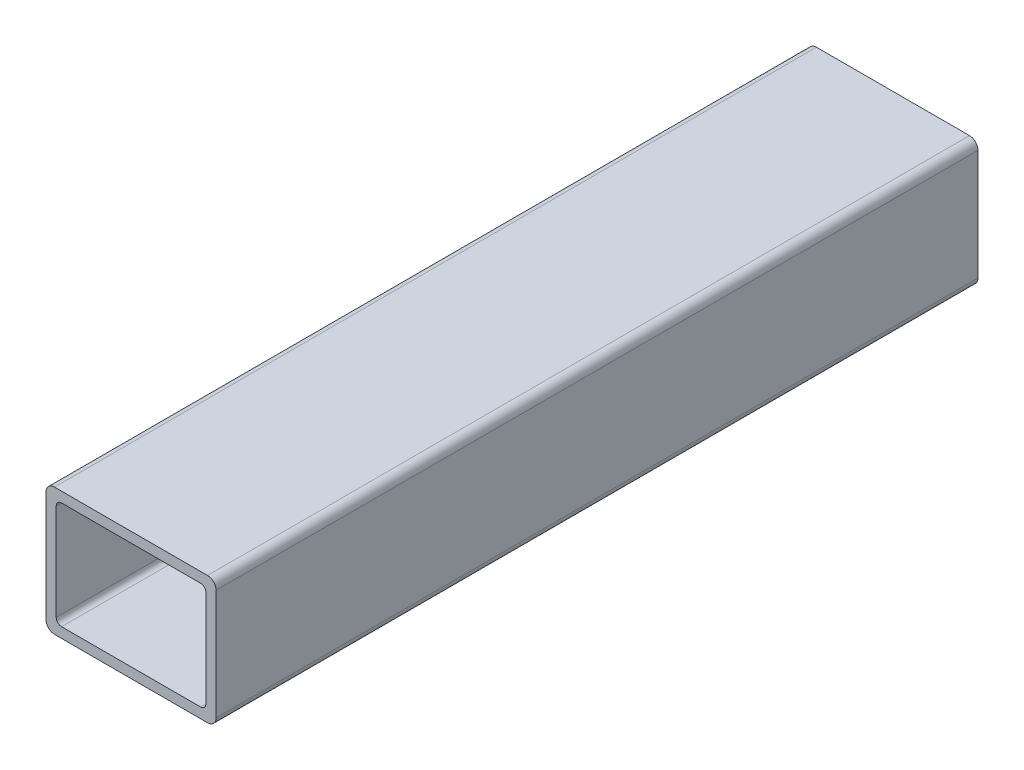
ISO-10303-21;
HEADER;
FILE_DESCRIPTION(('STEP AP214'),'2;1');
FILE_NAME('part.step','',(''),(''),'','','');
FILE_SCHEMA(('AUTOMOTIVE_DESIGN { 1 0 10303 214 1 1 1 1 }'));
ENDSEC;
DATA;
#1=APPLICATION_CONTEXT('core data for automotive mechanical design processes');
#2=APPLICATION_PROTOCOL_DEFINITION('international standard','automotive_design',2000,#1);
#3=PRODUCT_CONTEXT('',#1,'mechanical');
#4=PRODUCT('Part','Part','',(#3));
#5=PRODUCT_RELATED_PRODUCT_CATEGORY('part','',(#4));
#6=PRODUCT_DEFINITION_FORMATION('','',#4);
#7=PRODUCT_DEFINITION_CONTEXT('part definition',#1,'design');
#8=PRODUCT_DEFINITION('design','',#6,#7);
#9=PRODUCT_DEFINITION_SHAPE('','',#8);
#10=(LENGTH_UNIT() NAMED_UNIT(*) SI_UNIT(.MILLI.,.METRE.));
#11=(NAMED_UNIT(*) PLANE_ANGLE_UNIT() SI_UNIT($,.RADIAN.));
#12=(NAMED_UNIT(*) SI_UNIT($,.STERADIAN.) SOLID_ANGLE_UNIT());
#13=UNCERTAINTY_MEASURE_WITH_UNIT(LENGTH_MEASURE(1.E-05),#10,'distance_accuracy_value','');
#14=(GEOMETRIC_REPRESENTATION_CONTEXT(3) GLOBAL_UNCERTAINTY_ASSIGNED_CONTEXT((#13)) GLOBAL_UNIT_ASSIGNED_CONTEXT((#10,
#11,#12)) REPRESENTATION_CONTEXT('',''));
#15=CARTESIAN_POINT('',(0.,0.,0.));
#16=DIRECTION('',(0.,0.,1.));
#17=DIRECTION('',(1.,0.,0.));
#18=AXIS2_PLACEMENT_3D('',#15,#16,#17);
#19=CARTESIAN_POINT('',(22.86,-16.51,227.56368));
#20=DIRECTION('',(0.,0.,1.));
#21=DIRECTION('',(1.,0.,0.));
#22=AXIS2_PLACEMENT_3D('',#19,#20,#21);
#23=PLANE('',#22);
#24=CARTESIAN_POINT('',(22.86,-16.51,227.56368));
#25=DIRECTION('',(0.,0.,1.));
#26=DIRECTION('',(1.,0.,0.));
#27=AXIS2_PLACEMENT_3D('',#24,#25,#26);
#28=CIRCLE('',#27,2.53999999999999);
#29=CARTESIAN_POINT('',(22.86,-19.05,227.56368));
#30=VERTEX_POINT('',#29);
#31=CARTESIAN_POINT('',(25.4,-16.51,227.56368));
#32=VERTEX_POINT('',#31);
#33=EDGE_CURVE('E244',#30,#32,#28,.T.);
#34=ORIENTED_EDGE('',*,*,#33,.T.);
#35=DIRECTION('',(0.,1.,0.));
#36=VECTOR('',#35,1.);
#37=CARTESIAN_POINT('',(25.4,-16.51,227.56368));
#38=LINE('',#37,#36);
#39=CARTESIAN_POINT('',(25.4,16.51,227.56368));
#40=VERTEX_POINT('',#39);
#41=EDGE_CURVE('E248',#32,#40,#38,.T.);
#42=ORIENTED_EDGE('',*,*,#41,.T.);
#43=CARTESIAN_POINT('',(22.86,16.51,227.56368));
#44=DIRECTION('',(0.,0.,1.));
#45=DIRECTION('',(1.,0.,0.));
#46=AXIS2_PLACEMENT_3D('',#43,#44,#45);
#47=CIRCLE('',#46,2.54);
#48=CARTESIAN_POINT('',(22.86,19.05,227.56368));
#49=VERTEX_POINT('',#48);
#50=EDGE_CURVE('E252',#40,#49,#47,.T.);
#51=ORIENTED_EDGE('',*,*,#50,.T.);
#52=DIRECTION('',(-1.,0.,0.));
#53=VECTOR('',#52,1.);
#54=CARTESIAN_POINT('',(22.86,19.05,227.56368));
#55=LINE('',#54,#53);
#56=CARTESIAN_POINT('',(-22.86,19.05,227.56368));
#57=VERTEX_POINT('',#56);
#58=EDGE_CURVE('E255',#49,#57,#55,.T.);
#59=ORIENTED_EDGE('',*,*,#58,.T.);
#60=CARTESIAN_POINT('',(-22.86,16.51,227.56368));
#61=DIRECTION('',(0.,0.,1.));
#62=DIRECTION('',(1.,0.,0.));
#63=AXIS2_PLACEMENT_3D('',#60,#61,#62);
#64=CIRCLE('',#63,2.54);
#65=CARTESIAN_POINT('',(-25.4,16.51,227.56368));
#66=VERTEX_POINT('',#65);
#67=EDGE_CURVE('E258',#57,#66,#64,.T.);
#68=ORIENTED_EDGE('',*,*,#67,.T.);
#69=DIRECTION('',(0.,-1.,0.));
#70=VECTOR('',#69,1.);
#71=CARTESIAN_POINT('',(-25.4,-16.51,227.56368));
#72=LINE('',#71,#70);
#73=CARTESIAN_POINT('',(-25.4,-16.51,227.56368));
#74=VERTEX_POINT('',#73);
#75=EDGE_CURVE('E261',#66,#74,#72,.T.);
#76=ORIENTED_EDGE('',*,*,#75,.T.);
#77=CARTESIAN_POINT('',(-22.86,-16.51,227.56368));
#78=DIRECTION('',(0.,0.,1.));
#79=DIRECTION('',(1.,0.,0.));
#80=AXIS2_PLACEMENT_3D('',#77,#78,#79);
#81=CIRCLE('',#80,2.54);
#82=CARTESIAN_POINT('',(-22.86,-19.05,227.56368));
#83=VERTEX_POINT('',#82);
#84=EDGE_CURVE('E264',#74,#83,#81,.T.);
#85=ORIENTED_EDGE('',*,*,#84,.T.);
#86=DIRECTION('',(1.,0.,0.));
#87=VECTOR('',#86,1.);
#88=CARTESIAN_POINT('',(22.86,-19.05,227.56368));
#89=LINE('',#88,#87);
#90=EDGE_CURVE('E267',#83,#30,#89,.T.);
#91=ORIENTED_EDGE('',*,*,#90,.T.);
#92=EDGE_LOOP('',(#34,#42,#51,#59,#68,#76,#85,#91));
#93=FACE_BOUND('',#92,.T.);
#94=DIRECTION('',(-1.,0.,0.));
#95=VECTOR('',#94,1.);
#96=CARTESIAN_POINT('',(20.7518,16.002,227.56368));
#97=LINE('',#96,#95);
#98=CARTESIAN_POINT('',(20.7518,16.002,227.56368));
#99=VERTEX_POINT('',#98);
#100=CARTESIAN_POINT('',(-20.7518,16.002,227.56368));
#101=VERTEX_POINT('',#100);
#102=EDGE_CURVE('E164',#99,#101,#97,.T.);
#103=ORIENTED_EDGE('',*,*,#102,.F.);
#104=CARTESIAN_POINT('',(20.7518,14.4018,227.56368));
#105=DIRECTION('',(0.,0.,1.));
#106=DIRECTION('',(1.,0.,0.));
#107=AXIS2_PLACEMENT_3D('',#104,#105,#106);
#108=CIRCLE('',#107,1.6002);
#109=CARTESIAN_POINT('',(22.352,14.4018,227.56368));
#110=VERTEX_POINT('',#109);
#111=EDGE_CURVE('E155',#110,#99,#108,.T.);
#112=ORIENTED_EDGE('',*,*,#111,.F.);
#113=DIRECTION('',(0.,1.,0.));
#114=VECTOR('',#113,1.);
#115=CARTESIAN_POINT('',(22.352,14.4018,227.56368));
#116=LINE('',#115,#114);
#117=CARTESIAN_POINT('',(22.352,-14.4018,227.56368));
#118=VERTEX_POINT('',#117);
#119=EDGE_CURVE('E196',#118,#110,#116,.T.);
#120=ORIENTED_EDGE('',*,*,#119,.F.);
#121=CARTESIAN_POINT('',(20.7518,-14.4018,227.56368));
#122=DIRECTION('',(0.,0.,1.));
#123=DIRECTION('',(1.,0.,0.));
#124=AXIS2_PLACEMENT_3D('',#121,#122,#123);
#125=CIRCLE('',#124,1.6002);
#126=CARTESIAN_POINT('',(20.7518,-16.002,227.56368));
#127=VERTEX_POINT('',#126);
#128=EDGE_CURVE('E193',#127,#118,#125,.T.);
#129=ORIENTED_EDGE('',*,*,#128,.F.);
#130=DIRECTION('',(1.,0.,0.));
#131=VECTOR('',#130,1.);
#132=CARTESIAN_POINT('',(20.7518,-16.002,227.56368));
#133=LINE('',#132,#131);
#134=CARTESIAN_POINT('',(-20.7518,-16.002,227.56368));
#135=VERTEX_POINT('',#134);
#136=EDGE_CURVE('E190',#135,#127,#133,.T.);
#137=ORIENTED_EDGE('',*,*,#136,.F.);
#138=CARTESIAN_POINT('',(-20.7518,-14.4018,227.56368));
#139=DIRECTION('',(0.,0.,1.));
#140=DIRECTION('',(1.,0.,0.));
#141=AXIS2_PLACEMENT_3D('',#138,#139,#140);
#142=CIRCLE('',#141,1.6002);
#143=CARTESIAN_POINT('',(-22.352,-14.4018,227.56368));
#144=VERTEX_POINT('',#143);
#145=EDGE_CURVE('E187',#144,#135,#142,.T.);
#146=ORIENTED_EDGE('',*,*,#145,.F.);
#147=DIRECTION('',(0.,-1.,0.));
#148=VECTOR('',#147,1.);
#149=CARTESIAN_POINT('',(-22.352,14.4018,227.56368));
#150=LINE('',#149,#148);
#151=CARTESIAN_POINT('',(-22.352,14.4018,227.56368));
#152=VERTEX_POINT('',#151);
#153=EDGE_CURVE('E182',#152,#144,#150,.T.);
#154=ORIENTED_EDGE('',*,*,#153,.F.);
#155=CARTESIAN_POINT('',(-20.7518,14.4018,227.56368));
#156=DIRECTION('',(0.,0.,1.));
#157=DIRECTION('',(1.,0.,0.));
#158=AXIS2_PLACEMENT_3D('',#155,#156,#157);
#159=CIRCLE('',#158,1.6002);
#160=EDGE_CURVE('E178',#101,#152,#159,.T.);
#161=ORIENTED_EDGE('',*,*,#160,.F.);
#162=EDGE_LOOP('',(#103,#112,#120,#129,#137,#146,#154,#161));
#163=FACE_BOUND('',#162,.T.);
#164=ADVANCED_FACE('F41',(#93,#163),#23,.T.);
#165=CARTESIAN_POINT('',(22.86,-16.51,0.));
#166=DIRECTION('',(0.,0.,1.));
#167=DIRECTION('',(1.,0.,0.));
#168=AXIS2_PLACEMENT_3D('',#165,#166,#167);
#169=PLANE('',#168);
#170=CARTESIAN_POINT('',(22.86,-16.51,0.));
#171=DIRECTION('',(0.,0.,1.));
#172=DIRECTION('',(1.,0.,0.));
#173=AXIS2_PLACEMENT_3D('',#170,#171,#172);
#174=CIRCLE('',#173,2.53999999999999);
#175=CARTESIAN_POINT('',(22.86,-19.05,0.));
#176=VERTEX_POINT('',#175);
#177=CARTESIAN_POINT('',(25.4,-16.51,0.));
#178=VERTEX_POINT('',#177);
#179=EDGE_CURVE('E173',#176,#178,#174,.T.);
#180=ORIENTED_EDGE('',*,*,#179,.F.);
#181=DIRECTION('',(1.,0.,0.));
#182=VECTOR('',#181,1.);
#183=CARTESIAN_POINT('',(22.86,-19.05,0.));
#184=LINE('',#183,#182);
#185=CARTESIAN_POINT('',(-22.86,-19.05,0.));
#186=VERTEX_POINT('',#185);
#187=EDGE_CURVE('E249',#186,#176,#184,.T.);
#188=ORIENTED_EDGE('',*,*,#187,.F.);
#189=CARTESIAN_POINT('',(-22.86,-16.51,0.));
#190=DIRECTION('',(0.,0.,1.));
#191=DIRECTION('',(1.,0.,0.));
#192=AXIS2_PLACEMENT_3D('',#189,#190,#191);
#193=CIRCLE('',#192,2.54);
#194=CARTESIAN_POINT('',(-25.4,-16.51,0.));
#195=VERTEX_POINT('',#194);
#196=EDGE_CURVE('E289',#195,#186,#193,.T.);
#197=ORIENTED_EDGE('',*,*,#196,.F.);
#198=DIRECTION('',(0.,-1.,0.));
#199=VECTOR('',#198,1.);
#200=CARTESIAN_POINT('',(-25.4,-16.51,0.));
#201=LINE('',#200,#199);
#202=CARTESIAN_POINT('',(-25.4,16.51,0.));
#203=VERTEX_POINT('',#202);
#204=EDGE_CURVE('E286',#203,#195,#201,.T.);
#205=ORIENTED_EDGE('',*,*,#204,.F.);
#206=CARTESIAN_POINT('',(-22.86,16.51,0.));
#207=DIRECTION('',(0.,0.,1.));
#208=DIRECTION('',(1.,0.,0.));
#209=AXIS2_PLACEMENT_3D('',#206,#207,#208);
#210=CIRCLE('',#209,2.54);
#211=CARTESIAN_POINT('',(-22.86,19.05,0.));
#212=VERTEX_POINT('',#211);
#213=EDGE_CURVE('E283',#212,#203,#210,.T.);
#214=ORIENTED_EDGE('',*,*,#213,.F.);
#215=DIRECTION('',(-1.,0.,0.));
#216=VECTOR('',#215,1.);
#217=CARTESIAN_POINT('',(22.86,19.05,0.));
#218=LINE('',#217,#216);
#219=CARTESIAN_POINT('',(22.86,19.05,0.));
#220=VERTEX_POINT('',#219);
#221=EDGE_CURVE('E280',#220,#212,#218,.T.);
#222=ORIENTED_EDGE('',*,*,#221,.F.);
#223=CARTESIAN_POINT('',(22.86,16.51,0.));
#224=DIRECTION('',(0.,0.,1.));
#225=DIRECTION('',(1.,0.,0.));
#226=AXIS2_PLACEMENT_3D('',#223,#224,#225);
#227=CIRCLE('',#226,2.54);
#228=CARTESIAN_POINT('',(25.4,16.51,0.));
#229=VERTEX_POINT('',#228);
#230=EDGE_CURVE('E277',#229,#220,#227,.T.);
#231=ORIENTED_EDGE('',*,*,#230,.F.);
#232=DIRECTION('',(0.,1.,0.));
#233=VECTOR('',#232,1.);
#234=CARTESIAN_POINT('',(25.4,-16.51,0.));
#235=LINE('',#234,#233);
#236=EDGE_CURVE('E274',#178,#229,#235,.T.);
#237=ORIENTED_EDGE('',*,*,#236,.F.);
#238=EDGE_LOOP('',(#180,#188,#197,#205,#214,#222,#231,#237));
#239=FACE_BOUND('',#238,.T.);
#240=CARTESIAN_POINT('',(20.7518,14.4018,0.));
#241=DIRECTION('',(0.,0.,1.));
#242=DIRECTION('',(1.,0.,0.));
#243=AXIS2_PLACEMENT_3D('',#240,#241,#242);
#244=CIRCLE('',#243,1.6002);
#245=CARTESIAN_POINT('',(22.352,14.4018,0.));
#246=VERTEX_POINT('',#245);
#247=CARTESIAN_POINT('',(20.7518,16.002,0.));
#248=VERTEX_POINT('',#247);
#249=EDGE_CURVE('E65',#246,#248,#244,.T.);
#250=ORIENTED_EDGE('',*,*,#249,.T.);
#251=DIRECTION('',(-1.,0.,0.));
#252=VECTOR('',#251,1.);
#253=CARTESIAN_POINT('',(20.7518,16.002,0.));
#254=LINE('',#253,#252);
#255=CARTESIAN_POINT('',(-20.7518,16.002,0.));
#256=VERTEX_POINT('',#255);
#257=EDGE_CURVE('E171',#248,#256,#254,.T.);
#258=ORIENTED_EDGE('',*,*,#257,.T.);
#259=CARTESIAN_POINT('',(-20.7518,14.4018,0.));
#260=DIRECTION('',(0.,0.,1.));
#261=DIRECTION('',(1.,0.,0.));
#262=AXIS2_PLACEMENT_3D('',#259,#260,#261);
#263=CIRCLE('',#262,1.6002);
#264=CARTESIAN_POINT('',(-22.352,14.4018,0.));
#265=VERTEX_POINT('',#264);
#266=EDGE_CURVE('E203',#256,#265,#263,.T.);
#267=ORIENTED_EDGE('',*,*,#266,.T.);
#268=DIRECTION('',(0.,-1.,0.));
#269=VECTOR('',#268,1.);
#270=CARTESIAN_POINT('',(-22.352,14.4018,0.));
#271=LINE('',#270,#269);
#272=CARTESIAN_POINT('',(-22.352,-14.4018,0.));
#273=VERTEX_POINT('',#272);
#274=EDGE_CURVE('E207',#265,#273,#271,.T.);
#275=ORIENTED_EDGE('',*,*,#274,.T.);
#276=CARTESIAN_POINT('',(-20.7518,-14.4018,0.));
#277=DIRECTION('',(0.,0.,1.));
#278=DIRECTION('',(1.,0.,0.));
#279=AXIS2_PLACEMENT_3D('',#276,#277,#278);
#280=CIRCLE('',#279,1.6002);
#281=CARTESIAN_POINT('',(-20.7518,-16.002,0.));
#282=VERTEX_POINT('',#281);
#283=EDGE_CURVE('E211',#273,#282,#280,.T.);
#284=ORIENTED_EDGE('',*,*,#283,.T.);
#285=DIRECTION('',(1.,0.,0.));
#286=VECTOR('',#285,1.);
#287=CARTESIAN_POINT('',(20.7518,-16.002,0.));
#288=LINE('',#287,#286);
#289=CARTESIAN_POINT('',(20.7518,-16.002,0.));
#290=VERTEX_POINT('',#289);
#291=EDGE_CURVE('E215',#282,#290,#288,.T.);
#292=ORIENTED_EDGE('',*,*,#291,.T.);
#293=CARTESIAN_POINT('',(20.7518,-14.4018,0.));
#294=DIRECTION('',(0.,0.,1.));
#295=DIRECTION('',(1.,0.,0.));
#296=AXIS2_PLACEMENT_3D('',#293,#294,#295);
#297=CIRCLE('',#296,1.6002);
#298=CARTESIAN_POINT('',(22.352,-14.4018,0.));
#299=VERTEX_POINT('',#298);
#300=EDGE_CURVE('E219',#290,#299,#297,.T.);
#301=ORIENTED_EDGE('',*,*,#300,.T.);
#302=DIRECTION('',(0.,1.,0.));
#303=VECTOR('',#302,1.);
#304=CARTESIAN_POINT('',(22.352,14.4018,0.));
#305=LINE('',#304,#303);
#306=EDGE_CURVE('E165',#299,#246,#305,.T.);
#307=ORIENTED_EDGE('',*,*,#306,.T.);
#308=EDGE_LOOP('',(#250,#258,#267,#275,#284,#292,#301,#307));
#309=FACE_BOUND('',#308,.T.);
#310=ADVANCED_FACE('F328',(#239,#309),#169,.F.);
#311=CARTESIAN_POINT('',(22.86,-16.51,227.56368));
#312=DIRECTION('',(0.,0.,-1.));
#313=DIRECTION('',(-1.,0.,0.));
#314=AXIS2_PLACEMENT_3D('',#311,#312,#313);
#315=CYLINDRICAL_SURFACE('',#314,2.53999999999999);
#316=ORIENTED_EDGE('',*,*,#179,.T.);
#317=DIRECTION('',(0.,0.,-1.));
#318=VECTOR('',#317,1.);
#319=CARTESIAN_POINT('',(25.4,-16.51,227.56368));
#320=LINE('',#319,#318);
#321=EDGE_CURVE('E11',#32,#178,#320,.T.);
#322=ORIENTED_EDGE('',*,*,#321,.F.);
#323=ORIENTED_EDGE('',*,*,#33,.F.);
#324=DIRECTION('',(0.,0.,-1.));
#325=VECTOR('',#324,1.);
#326=CARTESIAN_POINT('',(22.86,-19.05,227.56368));
#327=LINE('',#326,#325);
#328=EDGE_CURVE('E270',#30,#176,#327,.T.);
#329=ORIENTED_EDGE('',*,*,#328,.T.);
#330=EDGE_LOOP('',(#316,#322,#323,#329));
#331=FACE_BOUND('',#330,.T.);
#332=ADVANCED_FACE('F43',(#331),#315,.T.);
#333=CARTESIAN_POINT('',(25.4,-16.51,227.56368));
#334=DIRECTION('',(-1.,0.,0.));
#335=DIRECTION('',(0.,0.,1.));
#336=AXIS2_PLACEMENT_3D('',#333,#334,#335);
#337=PLANE('',#336);
#338=ORIENTED_EDGE('',*,*,#236,.T.);
#339=DIRECTION('',(0.,0.,-1.));
#340=VECTOR('',#339,1.);
#341=CARTESIAN_POINT('',(25.4,16.51,227.56368));
#342=LINE('',#341,#340);
#343=EDGE_CURVE('E50',#40,#229,#342,.T.);
#344=ORIENTED_EDGE('',*,*,#343,.F.);
#345=ORIENTED_EDGE('',*,*,#41,.F.);
#346=ORIENTED_EDGE('',*,*,#321,.T.);
#347=EDGE_LOOP('',(#338,#344,#345,#346));
#348=FACE_BOUND('',#347,.T.);
#349=ADVANCED_FACE('F345',(#348),#337,.F.);
#350=CARTESIAN_POINT('',(22.86,16.51,227.56368));
#351=DIRECTION('',(0.,0.,-1.));
#352=DIRECTION('',(-1.,0.,0.));
#353=AXIS2_PLACEMENT_3D('',#350,#351,#352);
#354=CYLINDRICAL_SURFACE('',#353,2.54);
#355=ORIENTED_EDGE('',*,*,#230,.T.);
#356=DIRECTION('',(0.,0.,-1.));
#357=VECTOR('',#356,1.);
#358=CARTESIAN_POINT('',(22.86,19.05,227.56368));
#359=LINE('',#358,#357);
#360=EDGE_CURVE('E313',#49,#220,#359,.T.);
#361=ORIENTED_EDGE('',*,*,#360,.F.);
#362=ORIENTED_EDGE('',*,*,#50,.F.);
#363=ORIENTED_EDGE('',*,*,#343,.T.);
#364=EDGE_LOOP('',(#355,#361,#362,#363));
#365=FACE_BOUND('',#364,.T.);
#366=ADVANCED_FACE('F322',(#365),#354,.T.);
#367=CARTESIAN_POINT('',(22.86,19.05,227.56368));
#368=DIRECTION('',(0.,-1.,0.));
#369=DIRECTION('',(0.,0.,-1.));
#370=AXIS2_PLACEMENT_3D('',#367,#368,#369);
#371=PLANE('',#370);
#372=ORIENTED_EDGE('',*,*,#221,.T.);
#373=DIRECTION('',(0.,0.,-1.));
#374=VECTOR('',#373,1.);
#375=CARTESIAN_POINT('',(-22.86,19.05,227.56368));
#376=LINE('',#375,#374);
#377=EDGE_CURVE('E309',#57,#212,#376,.T.);
#378=ORIENTED_EDGE('',*,*,#377,.F.);
#379=ORIENTED_EDGE('',*,*,#58,.F.);
#380=ORIENTED_EDGE('',*,*,#360,.T.);
#381=EDGE_LOOP('',(#372,#378,#379,#380));
#382=FACE_BOUND('',#381,.T.);
#383=ADVANCED_FACE('F334',(#382),#371,.F.);
#384=CARTESIAN_POINT('',(-22.86,16.51,227.56368));
#385=DIRECTION('',(0.,0.,-1.));
#386=DIRECTION('',(-1.,0.,0.));
#387=AXIS2_PLACEMENT_3D('',#384,#385,#386);
#388=CYLINDRICAL_SURFACE('',#387,2.54);
#389=ORIENTED_EDGE('',*,*,#213,.T.);
#390=DIRECTION('',(0.,0.,-1.));
#391=VECTOR('',#390,1.);
#392=CARTESIAN_POINT('',(-25.4,16.51,227.56368));
#393=LINE('',#392,#391);
#394=EDGE_CURVE('E305',#66,#203,#393,.T.);
#395=ORIENTED_EDGE('',*,*,#394,.F.);
#396=ORIENTED_EDGE('',*,*,#67,.F.);
#397=ORIENTED_EDGE('',*,*,#377,.T.);
#398=EDGE_LOOP('',(#389,#395,#396,#397));
#399=FACE_BOUND('',#398,.T.);
#400=ADVANCED_FACE('F338',(#399),#388,.T.);
#401=CARTESIAN_POINT('',(-25.4,-16.51,227.56368));
#402=DIRECTION('',(1.,0.,0.));
#403=DIRECTION('',(0.,1.,0.));
#404=AXIS2_PLACEMENT_3D('',#401,#402,#403);
#405=PLANE('',#404);
#406=ORIENTED_EDGE('',*,*,#204,.T.);
#407=DIRECTION('',(0.,0.,-1.));
#408=VECTOR('',#407,1.);
#409=CARTESIAN_POINT('',(-25.4,-16.51,227.56368));
#410=LINE('',#409,#408);
#411=EDGE_CURVE('E301',#74,#195,#410,.T.);
#412=ORIENTED_EDGE('',*,*,#411,.F.);
#413=ORIENTED_EDGE('',*,*,#75,.F.);
#414=ORIENTED_EDGE('',*,*,#394,.T.);
#415=EDGE_LOOP('',(#406,#412,#413,#414));
#416=FACE_BOUND('',#415,.T.);
#417=ADVANCED_FACE('F358',(#416),#405,.F.);
#418=CARTESIAN_POINT('',(-22.86,-16.51,227.56368));
#419=DIRECTION('',(0.,0.,-1.));
#420=DIRECTION('',(-1.,0.,0.));
#421=AXIS2_PLACEMENT_3D('',#418,#419,#420);
#422=CYLINDRICAL_SURFACE('',#421,2.54);
#423=ORIENTED_EDGE('',*,*,#196,.T.);
#424=DIRECTION('',(0.,0.,-1.));
#425=VECTOR('',#424,1.);
#426=CARTESIAN_POINT('',(-22.86,-19.05,227.56368));
#427=LINE('',#426,#425);
#428=EDGE_CURVE('E297',#83,#186,#427,.T.);
#429=ORIENTED_EDGE('',*,*,#428,.F.);
#430=ORIENTED_EDGE('',*,*,#84,.F.);
#431=ORIENTED_EDGE('',*,*,#411,.T.);
#432=EDGE_LOOP('',(#423,#429,#430,#431));
#433=FACE_BOUND('',#432,.T.);
#434=ADVANCED_FACE('F356',(#433),#422,.T.);
#435=CARTESIAN_POINT('',(22.86,-19.05,227.56368));
#436=DIRECTION('',(0.,1.,0.));
#437=DIRECTION('',(-1.,0.,0.));
#438=AXIS2_PLACEMENT_3D('',#435,#436,#437);
#439=PLANE('',#438);
#440=ORIENTED_EDGE('',*,*,#187,.T.);
#441=ORIENTED_EDGE('',*,*,#328,.F.);
#442=ORIENTED_EDGE('',*,*,#90,.F.);
#443=ORIENTED_EDGE('',*,*,#428,.T.);
#444=EDGE_LOOP('',(#440,#441,#442,#443));
#445=FACE_BOUND('',#444,.T.);
#446=ADVANCED_FACE('F351',(#445),#439,.F.);
#447=CARTESIAN_POINT('',(20.7518,14.4018,227.56368));
#448=DIRECTION('',(0.,0.,-1.));
#449=DIRECTION('',(-1.,0.,0.));
#450=AXIS2_PLACEMENT_3D('',#447,#448,#449);
#451=CYLINDRICAL_SURFACE('',#450,1.6002);
#452=ORIENTED_EDGE('',*,*,#249,.F.);
#453=DIRECTION('',(0.,0.,-1.));
#454=VECTOR('',#453,1.);
#455=CARTESIAN_POINT('',(22.352,14.4018,227.56368));
#456=LINE('',#455,#454);
#457=EDGE_CURVE('E159',#110,#246,#456,.T.);
#458=ORIENTED_EDGE('',*,*,#457,.F.);
#459=ORIENTED_EDGE('',*,*,#111,.T.);
#460=DIRECTION('',(0.,0.,-1.));
#461=VECTOR('',#460,1.);
#462=CARTESIAN_POINT('',(20.7518,16.002,227.56368));
#463=LINE('',#462,#461);
#464=EDGE_CURVE('E158',#99,#248,#463,.T.);
#465=ORIENTED_EDGE('',*,*,#464,.T.);
#466=EDGE_LOOP('',(#452,#458,#459,#465));
#467=FACE_BOUND('',#466,.T.);
#468=ADVANCED_FACE('F157',(#467),#451,.F.);
#469=CARTESIAN_POINT('',(20.7518,16.002,227.56368));
#470=DIRECTION('',(0.,-1.,0.));
#471=DIRECTION('',(1.,0.,0.));
#472=AXIS2_PLACEMENT_3D('',#469,#470,#471);
#473=PLANE('',#472);
#474=ORIENTED_EDGE('',*,*,#257,.F.);
#475=ORIENTED_EDGE('',*,*,#464,.F.);
#476=ORIENTED_EDGE('',*,*,#102,.T.);
#477=DIRECTION('',(0.,0.,-1.));
#478=VECTOR('',#477,1.);
#479=CARTESIAN_POINT('',(-20.7518,16.002,227.56368));
#480=LINE('',#479,#478);
#481=EDGE_CURVE('E174',#101,#256,#480,.T.);
#482=ORIENTED_EDGE('',*,*,#481,.T.);
#483=EDGE_LOOP('',(#474,#475,#476,#482));
#484=FACE_BOUND('',#483,.T.);
#485=ADVANCED_FACE('F168',(#484),#473,.T.);
#486=CARTESIAN_POINT('',(-20.7518,14.4018,227.56368));
#487=DIRECTION('',(0.,0.,-1.));
#488=DIRECTION('',(-1.,0.,0.));
#489=AXIS2_PLACEMENT_3D('',#486,#487,#488);
#490=CYLINDRICAL_SURFACE('',#489,1.6002);
#491=ORIENTED_EDGE('',*,*,#266,.F.);
#492=ORIENTED_EDGE('',*,*,#481,.F.);
#493=ORIENTED_EDGE('',*,*,#160,.T.);
#494=DIRECTION('',(0.,0.,-1.));
#495=VECTOR('',#494,1.);
#496=CARTESIAN_POINT('',(-22.352,14.4018,227.56368));
#497=LINE('',#496,#495);
#498=EDGE_CURVE('E239',#152,#265,#497,.T.);
#499=ORIENTED_EDGE('',*,*,#498,.T.);
#500=EDGE_LOOP('',(#491,#492,#493,#499));
#501=FACE_BOUND('',#500,.T.);
#502=ADVANCED_FACE('F383',(#501),#490,.F.);
#503=CARTESIAN_POINT('',(-22.352,14.4018,227.56368));
#504=DIRECTION('',(1.,0.,0.));
#505=DIRECTION('',(0.,1.,0.));
#506=AXIS2_PLACEMENT_3D('',#503,#504,#505);
#507=PLANE('',#506);
#508=ORIENTED_EDGE('',*,*,#274,.F.);
#509=ORIENTED_EDGE('',*,*,#498,.F.);
#510=ORIENTED_EDGE('',*,*,#153,.T.);
#511=DIRECTION('',(0.,0.,-1.));
#512=VECTOR('',#511,1.);
#513=CARTESIAN_POINT('',(-22.352,-14.4018,227.56368));
#514=LINE('',#513,#512);
#515=EDGE_CURVE('E236',#144,#273,#514,.T.);
#516=ORIENTED_EDGE('',*,*,#515,.T.);
#517=EDGE_LOOP('',(#508,#509,#510,#516));
#518=FACE_BOUND('',#517,.T.);
#519=ADVANCED_FACE('F387',(#518),#507,.T.);
#520=CARTESIAN_POINT('',(-20.7518,-14.4018,227.56368));
#521=DIRECTION('',(0.,0.,-1.));
#522=DIRECTION('',(-1.,0.,0.));
#523=AXIS2_PLACEMENT_3D('',#520,#521,#522);
#524=CYLINDRICAL_SURFACE('',#523,1.6002);
#525=ORIENTED_EDGE('',*,*,#283,.F.);
#526=ORIENTED_EDGE('',*,*,#515,.F.);
#527=ORIENTED_EDGE('',*,*,#145,.T.);
#528=DIRECTION('',(0.,0.,-1.));
#529=VECTOR('',#528,1.);
#530=CARTESIAN_POINT('',(-20.7518,-16.002,227.56368));
#531=LINE('',#530,#529);
#532=EDGE_CURVE('E233',#135,#282,#531,.T.);
#533=ORIENTED_EDGE('',*,*,#532,.T.);
#534=EDGE_LOOP('',(#525,#526,#527,#533));
#535=FACE_BOUND('',#534,.T.);
#536=ADVANCED_FACE('F393',(#535),#524,.F.);
#537=CARTESIAN_POINT('',(20.7518,-16.002,227.56368));
#538=DIRECTION('',(0.,1.,0.));
#539=DIRECTION('',(-1.,0.,0.));
#540=AXIS2_PLACEMENT_3D('',#537,#538,#539);
#541=PLANE('',#540);
#542=ORIENTED_EDGE('',*,*,#291,.F.);
#543=ORIENTED_EDGE('',*,*,#532,.F.);
#544=ORIENTED_EDGE('',*,*,#136,.T.);
#545=DIRECTION('',(0.,0.,-1.));
#546=VECTOR('',#545,1.);
#547=CARTESIAN_POINT('',(20.7518,-16.002,227.56368));
#548=LINE('',#547,#546);
#549=EDGE_CURVE('E230',#127,#290,#548,.T.);
#550=ORIENTED_EDGE('',*,*,#549,.T.);
#551=EDGE_LOOP('',(#542,#543,#544,#550));
#552=FACE_BOUND('',#551,.T.);
#553=ADVANCED_FACE('F397',(#552),#541,.T.);
#554=CARTESIAN_POINT('',(20.7518,-14.4018,227.56368));
#555=DIRECTION('',(0.,0.,-1.));
#556=DIRECTION('',(-1.,0.,0.));
#557=AXIS2_PLACEMENT_3D('',#554,#555,#556);
#558=CYLINDRICAL_SURFACE('',#557,1.6002);
#559=ORIENTED_EDGE('',*,*,#300,.F.);
#560=ORIENTED_EDGE('',*,*,#549,.F.);
#561=ORIENTED_EDGE('',*,*,#128,.T.);
#562=DIRECTION('',(0.,0.,-1.));
#563=VECTOR('',#562,1.);
#564=CARTESIAN_POINT('',(22.352,-14.4018,227.56368));
#565=LINE('',#564,#563);
#566=EDGE_CURVE('E57',#118,#299,#565,.T.);
#567=ORIENTED_EDGE('',*,*,#566,.T.);
#568=EDGE_LOOP('',(#559,#560,#561,#567));
#569=FACE_BOUND('',#568,.T.);
#570=ADVANCED_FACE('F401',(#569),#558,.F.);
#571=CARTESIAN_POINT('',(22.352,14.4018,227.56368));
#572=DIRECTION('',(-1.,0.,0.));
#573=DIRECTION('',(0.,-1.,0.));
#574=AXIS2_PLACEMENT_3D('',#571,#572,#573);
#575=PLANE('',#574);
#576=ORIENTED_EDGE('',*,*,#306,.F.);
#577=ORIENTED_EDGE('',*,*,#566,.F.);
#578=ORIENTED_EDGE('',*,*,#119,.T.);
#579=ORIENTED_EDGE('',*,*,#457,.T.);
#580=EDGE_LOOP('',(#576,#577,#578,#579));
#581=FACE_BOUND('',#580,.T.);
#582=ADVANCED_FACE('F405',(#581),#575,.T.);
#583=CLOSED_SHELL('',(#164,#310,#332,#349,#366,#383,#400,#417,#434,#446,#468,#485,#502,#519,
#536,#553,#570,#582));
#584=MANIFOLD_SOLID_BREP('B2',#583);
#585=ADVANCED_BREP_SHAPE_REPRESENTATION('',(#18,#584),#14);
#586=SHAPE_DEFINITION_REPRESENTATION(#9,#585);
ENDSEC;
END-ISO-10303-21;
